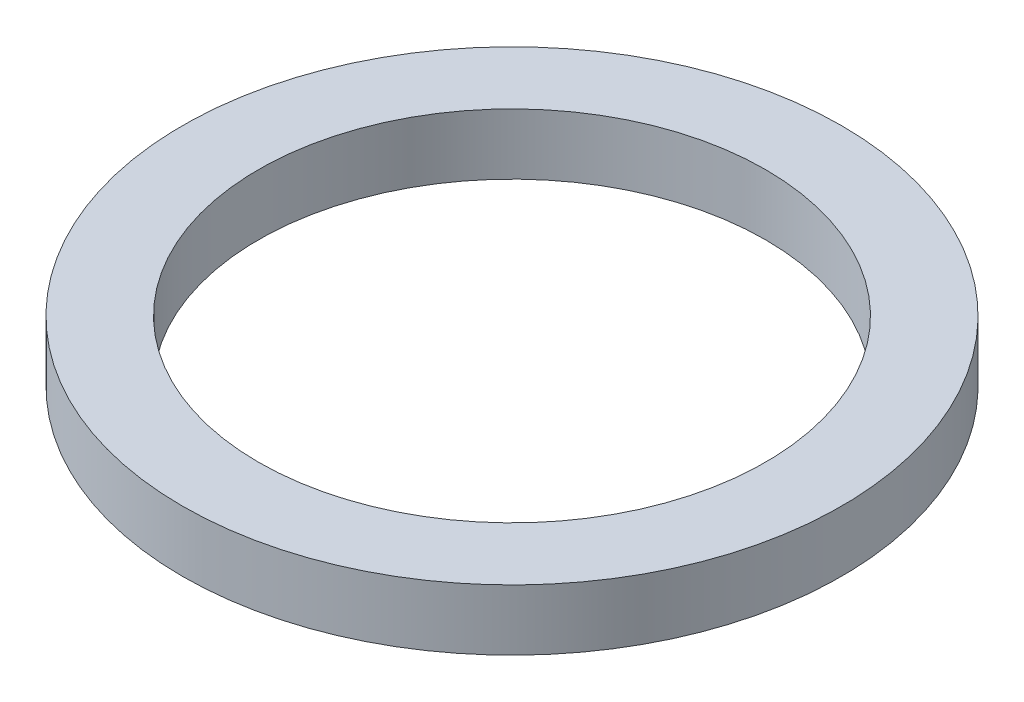
ISO-10303-21;
HEADER;
FILE_DESCRIPTION(('STEP AP214'),'2;1');
FILE_NAME('part.step','',(''),(''),'','','');
FILE_SCHEMA(('AUTOMOTIVE_DESIGN { 1 0 10303 214 1 1 1 1 }'));
ENDSEC;
DATA;
#1=APPLICATION_CONTEXT('core data for automotive mechanical design processes');
#2=APPLICATION_PROTOCOL_DEFINITION('international standard','automotive_design',2000,#1);
#3=PRODUCT_CONTEXT('',#1,'mechanical');
#4=PRODUCT('Part','Part','',(#3));
#5=PRODUCT_RELATED_PRODUCT_CATEGORY('part','',(#4));
#6=PRODUCT_DEFINITION_FORMATION('','',#4);
#7=PRODUCT_DEFINITION_CONTEXT('part definition',#1,'design');
#8=PRODUCT_DEFINITION('design','',#6,#7);
#9=PRODUCT_DEFINITION_SHAPE('','',#8);
#10=(LENGTH_UNIT() NAMED_UNIT(*) SI_UNIT(.MILLI.,.METRE.));
#11=(NAMED_UNIT(*) PLANE_ANGLE_UNIT() SI_UNIT($,.RADIAN.));
#12=(NAMED_UNIT(*) SI_UNIT($,.STERADIAN.) SOLID_ANGLE_UNIT());
#13=UNCERTAINTY_MEASURE_WITH_UNIT(LENGTH_MEASURE(1.E-05),#10,'distance_accuracy_value','');
#14=(GEOMETRIC_REPRESENTATION_CONTEXT(3) GLOBAL_UNCERTAINTY_ASSIGNED_CONTEXT((#13)) GLOBAL_UNIT_ASSIGNED_CONTEXT((#10,
#11,#12)) REPRESENTATION_CONTEXT('',''));
#15=CARTESIAN_POINT('',(0.,0.,0.));
#16=DIRECTION('',(0.,0.,1.));
#17=DIRECTION('',(1.,0.,0.));
#18=AXIS2_PLACEMENT_3D('',#15,#16,#17);
#19=CARTESIAN_POINT('',(0.,12.,0.));
#20=DIRECTION('',(0.,-1.,0.));
#21=DIRECTION('',(0.,0.,-1.));
#22=AXIS2_PLACEMENT_3D('',#19,#20,#21);
#23=CYLINDRICAL_SURFACE('',#22,65.);
#24=CARTESIAN_POINT('',(0.,12.,0.));
#25=DIRECTION('',(0.,1.,0.));
#26=DIRECTION('',(0.,0.,1.));
#27=AXIS2_PLACEMENT_3D('',#24,#25,#26);
#28=CIRCLE('',#27,65.);
#29=CARTESIAN_POINT('',(0.,12.,65.));
#30=VERTEX_POINT('',#29);
#31=EDGE_CURVE('E10',#30,#30,#28,.T.);
#32=ORIENTED_EDGE('',*,*,#31,.F.);
#33=EDGE_LOOP('',(#32));
#34=FACE_BOUND('',#33,.T.);
#35=CARTESIAN_POINT('',(0.,0.,0.));
#36=DIRECTION('',(0.,1.,0.));
#37=DIRECTION('',(0.,0.,1.));
#38=AXIS2_PLACEMENT_3D('',#35,#36,#37);
#39=CIRCLE('',#38,65.);
#40=CARTESIAN_POINT('',(0.,0.,65.));
#41=VERTEX_POINT('',#40);
#42=EDGE_CURVE('E37',#41,#41,#39,.T.);
#43=ORIENTED_EDGE('',*,*,#42,.T.);
#44=EDGE_LOOP('',(#43));
#45=FACE_BOUND('',#44,.T.);
#46=ADVANCED_FACE('F40',(#34,#45),#23,.T.);
#47=CARTESIAN_POINT('',(0.,12.,0.));
#48=DIRECTION('',(0.,1.,0.));
#49=DIRECTION('',(0.,0.,1.));
#50=AXIS2_PLACEMENT_3D('',#47,#48,#49);
#51=PLANE('',#50);
#52=CARTESIAN_POINT('',(0.,12.,0.));
#53=DIRECTION('',(0.,1.,0.));
#54=DIRECTION('',(0.,0.,1.));
#55=AXIS2_PLACEMENT_3D('',#52,#53,#54);
#56=CIRCLE('',#55,50.);
#57=CARTESIAN_POINT('',(0.,12.,50.));
#58=VERTEX_POINT('',#57);
#59=EDGE_CURVE('E50',#58,#58,#56,.T.);
#60=ORIENTED_EDGE('',*,*,#59,.F.);
#61=EDGE_LOOP('',(#60));
#62=FACE_BOUND('',#61,.T.);
#63=ORIENTED_EDGE('',*,*,#31,.T.);
#64=EDGE_LOOP('',(#63));
#65=FACE_BOUND('',#64,.T.);
#66=ADVANCED_FACE('F59',(#62,#65),#51,.T.);
#67=CARTESIAN_POINT('',(0.,0.,0.));
#68=DIRECTION('',(0.,1.,0.));
#69=DIRECTION('',(0.,0.,1.));
#70=AXIS2_PLACEMENT_3D('',#67,#68,#69);
#71=PLANE('',#70);
#72=CARTESIAN_POINT('',(0.,0.,0.));
#73=DIRECTION('',(0.,1.,0.));
#74=DIRECTION('',(0.,0.,1.));
#75=AXIS2_PLACEMENT_3D('',#72,#73,#74);
#76=CIRCLE('',#75,50.);
#77=CARTESIAN_POINT('',(0.,0.,50.));
#78=VERTEX_POINT('',#77);
#79=EDGE_CURVE('E47',#78,#78,#76,.T.);
#80=ORIENTED_EDGE('',*,*,#79,.T.);
#81=EDGE_LOOP('',(#80));
#82=FACE_BOUND('',#81,.T.);
#83=ORIENTED_EDGE('',*,*,#42,.F.);
#84=EDGE_LOOP('',(#83));
#85=FACE_BOUND('',#84,.T.);
#86=ADVANCED_FACE('F58',(#82,#85),#71,.F.);
#87=CARTESIAN_POINT('',(0.,12.,0.));
#88=DIRECTION('',(0.,-1.,0.));
#89=DIRECTION('',(0.,0.,-1.));
#90=AXIS2_PLACEMENT_3D('',#87,#88,#89);
#91=CYLINDRICAL_SURFACE('',#90,50.);
#92=ORIENTED_EDGE('',*,*,#59,.T.);
#93=EDGE_LOOP('',(#92));
#94=FACE_BOUND('',#93,.T.);
#95=ORIENTED_EDGE('',*,*,#79,.F.);
#96=EDGE_LOOP('',(#95));
#97=FACE_BOUND('',#96,.T.);
#98=ADVANCED_FACE('F54',(#94,#97),#91,.F.);
#99=CLOSED_SHELL('',(#46,#66,#86,#98));
#100=MANIFOLD_SOLID_BREP('B2',#99);
#101=ADVANCED_BREP_SHAPE_REPRESENTATION('',(#18,#100),#14);
#102=SHAPE_DEFINITION_REPRESENTATION(#9,#101);
ENDSEC;
END-ISO-10303-21;
